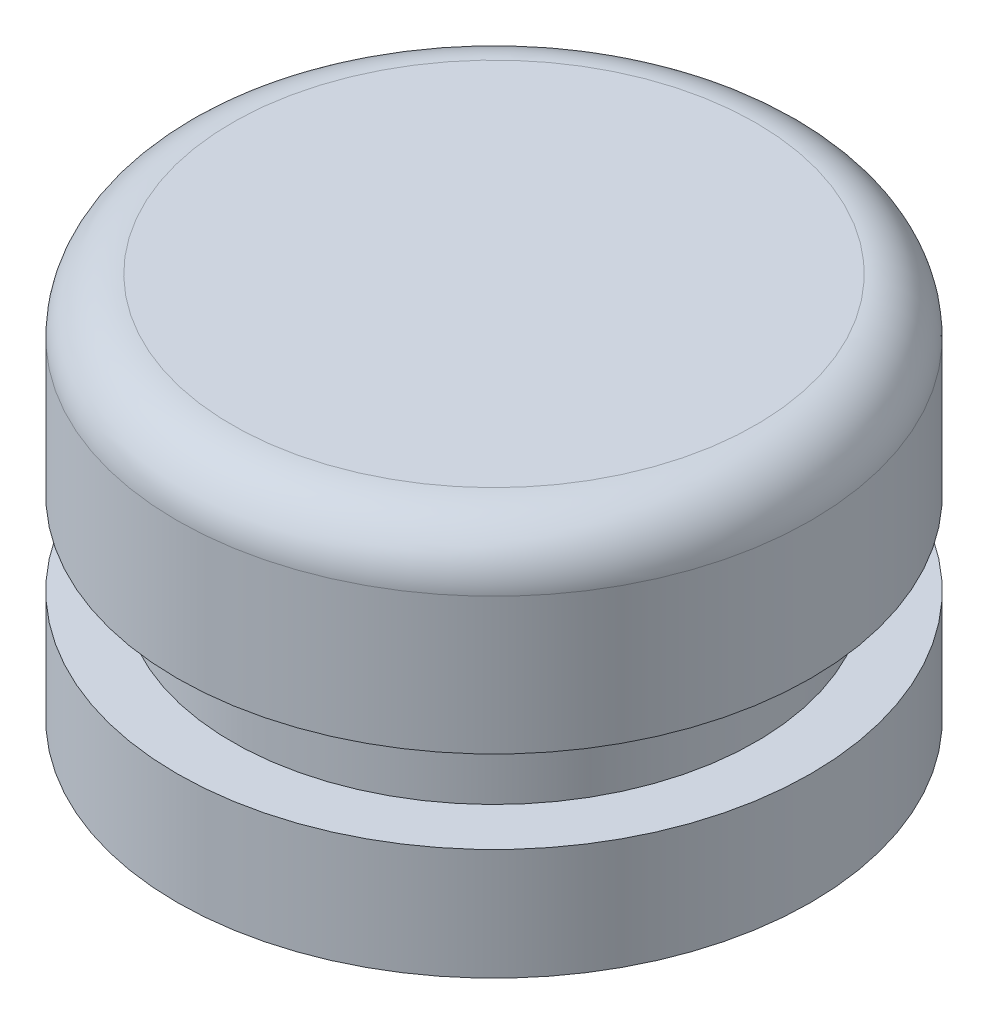
ISO-10303-21;
HEADER;
FILE_DESCRIPTION(('STEP AP214'),'2;1');
FILE_NAME('part.step','',(''),(''),'','','');
FILE_SCHEMA(('AUTOMOTIVE_DESIGN { 1 0 10303 214 1 1 1 1 }'));
ENDSEC;
DATA;
#1=APPLICATION_CONTEXT('core data for automotive mechanical design processes');
#2=APPLICATION_PROTOCOL_DEFINITION('international standard','automotive_design',2000,#1);
#3=PRODUCT_CONTEXT('',#1,'mechanical');
#4=PRODUCT('Part','Part','',(#3));
#5=PRODUCT_RELATED_PRODUCT_CATEGORY('part','',(#4));
#6=PRODUCT_DEFINITION_FORMATION('','',#4);
#7=PRODUCT_DEFINITION_CONTEXT('part definition',#1,'design');
#8=PRODUCT_DEFINITION('design','',#6,#7);
#9=PRODUCT_DEFINITION_SHAPE('','',#8);
#10=(LENGTH_UNIT() NAMED_UNIT(*) SI_UNIT(.MILLI.,.METRE.));
#11=(NAMED_UNIT(*) PLANE_ANGLE_UNIT() SI_UNIT($,.RADIAN.));
#12=(NAMED_UNIT(*) SI_UNIT($,.STERADIAN.) SOLID_ANGLE_UNIT());
#13=UNCERTAINTY_MEASURE_WITH_UNIT(LENGTH_MEASURE(1.E-05),#10,'distance_accuracy_value','');
#14=(GEOMETRIC_REPRESENTATION_CONTEXT(3) GLOBAL_UNCERTAINTY_ASSIGNED_CONTEXT((#13)) GLOBAL_UNIT_ASSIGNED_CONTEXT((#10,
#11,#12)) REPRESENTATION_CONTEXT('',''));
#15=CARTESIAN_POINT('',(0.,0.,0.));
#16=DIRECTION('',(0.,0.,1.));
#17=DIRECTION('',(1.,0.,0.));
#18=AXIS2_PLACEMENT_3D('',#15,#16,#17);
#19=CARTESIAN_POINT('',(-0.500000000000001,1.95625977809188,0.));
#20=DIRECTION('',(0.,-1.,0.));
#21=DIRECTION('',(0.,0.,-1.));
#22=AXIS2_PLACEMENT_3D('',#19,#20,#21);
#23=CYLINDRICAL_SURFACE('',#22,5.75);
#24=CARTESIAN_POINT('',(-0.500000000000001,7.95625977809188,0.));
#25=DIRECTION('',(0.,-1.,0.));
#26=DIRECTION('',(0.,0.,-1.));
#27=AXIS2_PLACEMENT_3D('',#24,#25,#26);
#28=CIRCLE('',#27,5.75);
#29=CARTESIAN_POINT('',(-0.500000000000001,7.95625977809188,-5.75));
#30=VERTEX_POINT('',#29);
#31=EDGE_CURVE('E37',#30,#30,#28,.T.);
#32=ORIENTED_EDGE('',*,*,#31,.T.);
#33=EDGE_LOOP('',(#32));
#34=FACE_BOUND('',#33,.T.);
#35=CARTESIAN_POINT('',(-0.500000000000001,5.47798026276466,0.));
#36=DIRECTION('',(0.,-1.,0.));
#37=DIRECTION('',(0.,0.,-1.));
#38=AXIS2_PLACEMENT_3D('',#35,#36,#37);
#39=CIRCLE('',#38,5.75);
#40=CARTESIAN_POINT('',(-0.500000000000001,5.47798026276466,-5.75));
#41=VERTEX_POINT('',#40);
#42=EDGE_CURVE('E56',#41,#41,#39,.T.);
#43=ORIENTED_EDGE('',*,*,#42,.F.);
#44=EDGE_LOOP('',(#43));
#45=FACE_BOUND('',#44,.T.);
#46=ADVANCED_FACE('F30',(#34,#45),#23,.T.);
#47=CARTESIAN_POINT('',(-6.25,5.47798026276466,0.));
#48=DIRECTION('',(0.,1.,0.));
#49=DIRECTION('',(0.,0.,1.));
#50=AXIS2_PLACEMENT_3D('',#47,#48,#49);
#51=PLANE('',#50);
#52=CARTESIAN_POINT('',(-0.500000000000001,5.47798026276466,0.));
#53=DIRECTION('',(0.,-1.,0.));
#54=DIRECTION('',(0.,0.,-1.));
#55=AXIS2_PLACEMENT_3D('',#52,#53,#54);
#56=CIRCLE('',#55,4.75);
#57=CARTESIAN_POINT('',(-0.500000000000001,5.47798026276466,-4.75));
#58=VERTEX_POINT('',#57);
#59=EDGE_CURVE('E59',#58,#58,#56,.T.);
#60=ORIENTED_EDGE('',*,*,#59,.F.);
#61=EDGE_LOOP('',(#60));
#62=FACE_BOUND('',#61,.T.);
#63=ORIENTED_EDGE('',*,*,#42,.T.);
#64=EDGE_LOOP('',(#63));
#65=FACE_BOUND('',#64,.T.);
#66=ADVANCED_FACE('F104',(#62,#65),#51,.F.);
#67=CARTESIAN_POINT('',(-0.500000000000001,1.95625977809188,0.));
#68=DIRECTION('',(0.,-1.,0.));
#69=DIRECTION('',(0.,0.,-1.));
#70=AXIS2_PLACEMENT_3D('',#67,#68,#69);
#71=CYLINDRICAL_SURFACE('',#70,4.75);
#72=CARTESIAN_POINT('',(-0.500000000000001,3.97798026276466,0.));
#73=DIRECTION('',(0.,-1.,0.));
#74=DIRECTION('',(0.,0.,-1.));
#75=AXIS2_PLACEMENT_3D('',#72,#73,#74);
#76=CIRCLE('',#75,4.75);
#77=CARTESIAN_POINT('',(-0.500000000000001,3.97798026276466,-4.75));
#78=VERTEX_POINT('',#77);
#79=EDGE_CURVE('E62',#78,#78,#76,.T.);
#80=ORIENTED_EDGE('',*,*,#79,.F.);
#81=EDGE_LOOP('',(#80));
#82=FACE_BOUND('',#81,.T.);
#83=ORIENTED_EDGE('',*,*,#59,.T.);
#84=EDGE_LOOP('',(#83));
#85=FACE_BOUND('',#84,.T.);
#86=ADVANCED_FACE('F109',(#82,#85),#71,.T.);
#87=CARTESIAN_POINT('',(-5.25,3.97798026276466,0.));
#88=DIRECTION('',(0.,-1.,0.));
#89=DIRECTION('',(0.,0.,-1.));
#90=AXIS2_PLACEMENT_3D('',#87,#88,#89);
#91=PLANE('',#90);
#92=CARTESIAN_POINT('',(-0.500000000000001,3.97798026276466,0.));
#93=DIRECTION('',(0.,-1.,0.));
#94=DIRECTION('',(0.,0.,-1.));
#95=AXIS2_PLACEMENT_3D('',#92,#93,#94);
#96=CIRCLE('',#95,5.75);
#97=CARTESIAN_POINT('',(-0.500000000000001,3.97798026276466,-5.75));
#98=VERTEX_POINT('',#97);
#99=EDGE_CURVE('E65',#98,#98,#96,.T.);
#100=ORIENTED_EDGE('',*,*,#99,.F.);
#101=EDGE_LOOP('',(#100));
#102=FACE_BOUND('',#101,.T.);
#103=ORIENTED_EDGE('',*,*,#79,.T.);
#104=EDGE_LOOP('',(#103));
#105=FACE_BOUND('',#104,.T.);
#106=ADVANCED_FACE('F144',(#102,#105),#91,.F.);
#107=CARTESIAN_POINT('',(-0.500000000000001,1.95625977809188,0.));
#108=DIRECTION('',(0.,-1.,0.));
#109=DIRECTION('',(0.,0.,-1.));
#110=AXIS2_PLACEMENT_3D('',#107,#108,#109);
#111=CYLINDRICAL_SURFACE('',#110,5.75);
#112=CARTESIAN_POINT('',(-0.500000000000001,1.95625977809188,0.));
#113=DIRECTION('',(0.,-1.,0.));
#114=DIRECTION('',(0.,0.,-1.));
#115=AXIS2_PLACEMENT_3D('',#112,#113,#114);
#116=CIRCLE('',#115,5.75);
#117=CARTESIAN_POINT('',(-0.500000000000001,1.95625977809188,-5.75));
#118=VERTEX_POINT('',#117);
#119=EDGE_CURVE('E68',#118,#118,#116,.T.);
#120=ORIENTED_EDGE('',*,*,#119,.F.);
#121=EDGE_LOOP('',(#120));
#122=FACE_BOUND('',#121,.T.);
#123=ORIENTED_EDGE('',*,*,#99,.T.);
#124=EDGE_LOOP('',(#123));
#125=FACE_BOUND('',#124,.T.);
#126=ADVANCED_FACE('F140',(#122,#125),#111,.T.);
#127=CARTESIAN_POINT('',(-5.25,1.95625977809188,0.));
#128=DIRECTION('',(0.,1.,0.));
#129=DIRECTION('',(0.,0.,1.));
#130=AXIS2_PLACEMENT_3D('',#127,#128,#129);
#131=PLANE('',#130);
#132=CARTESIAN_POINT('',(-0.500000000000001,1.95625977809188,0.));
#133=DIRECTION('',(0.,-1.,0.));
#134=DIRECTION('',(0.,0.,-1.));
#135=AXIS2_PLACEMENT_3D('',#132,#133,#134);
#136=CIRCLE('',#135,4.75);
#137=CARTESIAN_POINT('',(-0.500000000000001,1.95625977809188,-4.75));
#138=VERTEX_POINT('',#137);
#139=EDGE_CURVE('E71',#138,#138,#136,.T.);
#140=ORIENTED_EDGE('',*,*,#139,.F.);
#141=EDGE_LOOP('',(#140));
#142=FACE_BOUND('',#141,.T.);
#143=ORIENTED_EDGE('',*,*,#119,.T.);
#144=EDGE_LOOP('',(#143));
#145=FACE_BOUND('',#144,.T.);
#146=ADVANCED_FACE('F133',(#142,#145),#131,.F.);
#147=CARTESIAN_POINT('',(-0.500000000000001,1.95625977809188,0.));
#148=DIRECTION('',(0.,-1.,0.));
#149=DIRECTION('',(0.,0.,-1.));
#150=AXIS2_PLACEMENT_3D('',#147,#148,#149);
#151=CYLINDRICAL_SURFACE('',#150,4.75);
#152=CARTESIAN_POINT('',(-0.500000000000001,2.06427975926894,0.));
#153=DIRECTION('',(0.,-1.,0.));
#154=DIRECTION('',(0.,0.,-1.));
#155=AXIS2_PLACEMENT_3D('',#152,#153,#154);
#156=CIRCLE('',#155,4.75);
#157=CARTESIAN_POINT('',(-0.500000000000001,2.06427975926894,-4.75));
#158=VERTEX_POINT('',#157);
#159=EDGE_CURVE('E45',#158,#158,#156,.F.);
#160=ORIENTED_EDGE('',*,*,#159,.T.);
#161=EDGE_LOOP('',(#160));
#162=FACE_BOUND('',#161,.T.);
#163=ORIENTED_EDGE('',*,*,#139,.T.);
#164=EDGE_LOOP('',(#163));
#165=FACE_BOUND('',#164,.T.);
#166=ADVANCED_FACE('F127',(#162,#165),#151,.F.);
#167=CARTESIAN_POINT('',(-0.500000000000001,1.95625977809188,0.));
#168=DIRECTION('',(0.,-1.,0.));
#169=DIRECTION('',(0.,0.,-1.));
#170=AXIS2_PLACEMENT_3D('',#167,#168,#169);
#171=CYLINDRICAL_SURFACE('',#170,3.75);
#172=CARTESIAN_POINT('',(-0.500000000000001,4.74592945519578,0.));
#173=DIRECTION('',(0.,1.,0.));
#174=DIRECTION('',(0.,0.,1.));
#175=AXIS2_PLACEMENT_3D('',#172,#173,#174);
#176=CIRCLE('',#175,3.75);
#177=CARTESIAN_POINT('',(-0.500000000000001,4.74592945519578,3.75));
#178=VERTEX_POINT('',#177);
#179=EDGE_CURVE('E41',#178,#178,#176,.T.);
#180=ORIENTED_EDGE('',*,*,#179,.T.);
#181=EDGE_LOOP('',(#180));
#182=FACE_BOUND('',#181,.T.);
#183=CARTESIAN_POINT('',(-0.500000000000001,4.71003107033353,0.));
#184=DIRECTION('',(0.,-1.,0.));
#185=DIRECTION('',(0.,0.,-1.));
#186=AXIS2_PLACEMENT_3D('',#183,#184,#185);
#187=CIRCLE('',#186,3.75);
#188=CARTESIAN_POINT('',(-0.500000000000001,4.71003107033353,-3.75));
#189=VERTEX_POINT('',#188);
#190=EDGE_CURVE('E53',#189,#189,#187,.T.);
#191=ORIENTED_EDGE('',*,*,#190,.T.);
#192=EDGE_LOOP('',(#191));
#193=FACE_BOUND('',#192,.T.);
#194=ADVANCED_FACE('F86',(#182,#193),#171,.F.);
#195=CARTESIAN_POINT('',(-0.500000000000001,1.95625977809188,0.));
#196=DIRECTION('',(0.,-1.,0.));
#197=DIRECTION('',(0.,0.,-1.));
#198=AXIS2_PLACEMENT_3D('',#195,#196,#197);
#199=CYLINDRICAL_SURFACE('',#198,4.75);
#200=CARTESIAN_POINT('',(-0.500000000000001,7.95625977809188,0.));
#201=DIRECTION('',(0.,-1.,0.));
#202=DIRECTION('',(0.,0.,-1.));
#203=AXIS2_PLACEMENT_3D('',#200,#201,#202);
#204=CIRCLE('',#203,4.75);
#205=CARTESIAN_POINT('',(-0.500000000000001,7.95625977809188,-4.75));
#206=VERTEX_POINT('',#205);
#207=EDGE_CURVE('E77',#206,#206,#204,.T.);
#208=ORIENTED_EDGE('',*,*,#207,.F.);
#209=EDGE_LOOP('',(#208));
#210=FACE_BOUND('',#209,.T.);
#211=CARTESIAN_POINT('',(-0.500000000000001,6.47798026276466,0.));
#212=DIRECTION('',(0.,-1.,0.));
#213=DIRECTION('',(0.,0.,-1.));
#214=AXIS2_PLACEMENT_3D('',#211,#212,#213);
#215=CIRCLE('',#214,4.75);
#216=CARTESIAN_POINT('',(-0.500000000000001,6.47798026276466,-4.75));
#217=VERTEX_POINT('',#216);
#218=EDGE_CURVE('E74',#217,#217,#215,.T.);
#219=ORIENTED_EDGE('',*,*,#218,.T.);
#220=EDGE_LOOP('',(#219));
#221=FACE_BOUND('',#220,.T.);
#222=ADVANCED_FACE('F83',(#210,#221),#199,.F.);
#223=CARTESIAN_POINT('',(-0.500000000000001,7.95625977809188,0.));
#224=DIRECTION('',(0.,1.,0.));
#225=DIRECTION('',(0.,0.,1.));
#226=AXIS2_PLACEMENT_3D('',#223,#224,#225);
#227=PLANE('',#226);
#228=ORIENTED_EDGE('',*,*,#207,.T.);
#229=EDGE_LOOP('',(#228));
#230=FACE_BOUND('',#229,.T.);
#231=ADVANCED_FACE('F81',(#230),#227,.F.);
#232=CARTESIAN_POINT('',(-0.500000000000001,8.95625977809188,0.));
#233=DIRECTION('',(0.,-1.,0.));
#234=DIRECTION('',(0.,0.,-1.));
#235=AXIS2_PLACEMENT_3D('',#232,#233,#234);
#236=PLANE('',#235);
#237=CARTESIAN_POINT('',(-0.500000000000001,8.95625977809188,0.));
#238=DIRECTION('',(0.,-1.,0.));
#239=DIRECTION('',(0.,0.,-1.));
#240=AXIS2_PLACEMENT_3D('',#237,#238,#239);
#241=CIRCLE('',#240,4.75);
#242=CARTESIAN_POINT('',(-0.500000000000001,8.95625977809188,-4.75));
#243=VERTEX_POINT('',#242);
#244=EDGE_CURVE('E10',#243,#243,#241,.F.);
#245=ORIENTED_EDGE('',*,*,#244,.T.);
#246=EDGE_LOOP('',(#245));
#247=FACE_BOUND('',#246,.T.);
#248=ADVANCED_FACE('F116',(#247),#236,.F.);
#249=CARTESIAN_POINT('',(-0.500000000000001,4.71003107033353,0.));
#250=DIRECTION('',(0.,-1.,0.));
#251=DIRECTION('',(0.,0.,-1.));
#252=AXIS2_PLACEMENT_3D('',#249,#250,#251);
#253=TOROIDAL_SURFACE('',#252,5.75,2.);
#254=CARTESIAN_POINT('',(-0.500000000000001,3.38715541480124,0.));
#255=DIRECTION('',(0.,1.,0.));
#256=DIRECTION('',(0.,0.,1.));
#257=AXIS2_PLACEMENT_3D('',#254,#255,#256);
#258=CIRCLE('',#257,4.25);
#259=CARTESIAN_POINT('',(-0.500000000000001,3.38715541480124,4.25));
#260=VERTEX_POINT('',#259);
#261=EDGE_CURVE('E50',#260,#260,#258,.F.);
#262=ORIENTED_EDGE('',*,*,#261,.T.);
#263=EDGE_LOOP('',(#262));
#264=FACE_BOUND('',#263,.T.);
#265=ORIENTED_EDGE('',*,*,#190,.F.);
#266=EDGE_LOOP('',(#265));
#267=FACE_BOUND('',#266,.T.);
#268=ADVANCED_FACE('F99',(#264,#267),#253,.T.);
#269=CARTESIAN_POINT('',(-0.500000000000001,2.06427975926894,0.));
#270=DIRECTION('',(0.,-1.,0.));
#271=DIRECTION('',(0.,0.,-1.));
#272=AXIS2_PLACEMENT_3D('',#269,#270,#271);
#273=TOROIDAL_SURFACE('',#272,2.75,2.);
#274=ORIENTED_EDGE('',*,*,#159,.F.);
#275=EDGE_LOOP('',(#274));
#276=FACE_BOUND('',#275,.T.);
#277=ORIENTED_EDGE('',*,*,#261,.F.);
#278=EDGE_LOOP('',(#277));
#279=FACE_BOUND('',#278,.T.);
#280=ADVANCED_FACE('F92',(#276,#279),#273,.F.);
#281=CARTESIAN_POINT('',(-0.500000000000001,4.74592945519578,0.));
#282=DIRECTION('',(0.,1.,0.));
#283=DIRECTION('',(0.,0.,1.));
#284=AXIS2_PLACEMENT_3D('',#281,#282,#283);
#285=TOROIDAL_SURFACE('',#284,5.75,2.);
#286=ORIENTED_EDGE('',*,*,#179,.F.);
#287=EDGE_LOOP('',(#286));
#288=FACE_BOUND('',#287,.T.);
#289=ORIENTED_EDGE('',*,*,#218,.F.);
#290=EDGE_LOOP('',(#289));
#291=FACE_BOUND('',#290,.T.);
#292=ADVANCED_FACE('F90',(#288,#291),#285,.T.);
#293=CARTESIAN_POINT('',(-0.500000000000001,7.95625977809188,0.));
#294=DIRECTION('',(0.,-1.,0.));
#295=DIRECTION('',(0.,0.,-1.));
#296=AXIS2_PLACEMENT_3D('',#293,#294,#295);
#297=TOROIDAL_SURFACE('',#296,4.75,1.);
#298=ORIENTED_EDGE('',*,*,#244,.F.);
#299=EDGE_LOOP('',(#298));
#300=FACE_BOUND('',#299,.T.);
#301=ORIENTED_EDGE('',*,*,#31,.F.);
#302=EDGE_LOOP('',(#301));
#303=FACE_BOUND('',#302,.T.);
#304=ADVANCED_FACE('F32',(#300,#303),#297,.T.);
#305=CLOSED_SHELL('',(#46,#66,#86,#106,#126,#146,#166,#194,#222,#231,#248,#268,#280,#292,#304));
#306=MANIFOLD_SOLID_BREP('B2',#305);
#307=ADVANCED_BREP_SHAPE_REPRESENTATION('',(#18,#306),#14);
#308=SHAPE_DEFINITION_REPRESENTATION(#9,#307);
ENDSEC;
END-ISO-10303-21;
